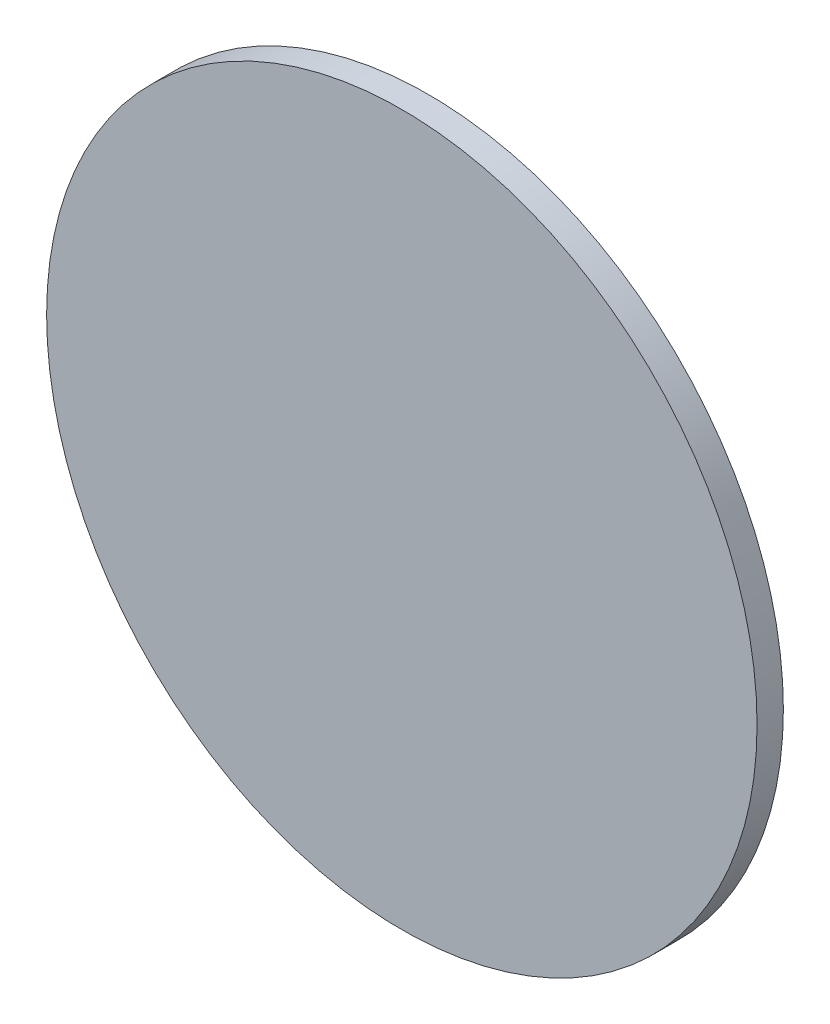
ISO-10303-21;
HEADER;
FILE_DESCRIPTION(('STEP AP214'),'2;1');
FILE_NAME('part.step','',(''),(''),'','','');
FILE_SCHEMA(('AUTOMOTIVE_DESIGN { 1 0 10303 214 1 1 1 1 }'));
ENDSEC;
DATA;
#1=APPLICATION_CONTEXT('core data for automotive mechanical design processes');
#2=APPLICATION_PROTOCOL_DEFINITION('international standard','automotive_design',2000,#1);
#3=PRODUCT_CONTEXT('',#1,'mechanical');
#4=PRODUCT('Part','Part','',(#3));
#5=PRODUCT_RELATED_PRODUCT_CATEGORY('part','',(#4));
#6=PRODUCT_DEFINITION_FORMATION('','',#4);
#7=PRODUCT_DEFINITION_CONTEXT('part definition',#1,'design');
#8=PRODUCT_DEFINITION('design','',#6,#7);
#9=PRODUCT_DEFINITION_SHAPE('','',#8);
#10=(LENGTH_UNIT() NAMED_UNIT(*) SI_UNIT(.MILLI.,.METRE.));
#11=(NAMED_UNIT(*) PLANE_ANGLE_UNIT() SI_UNIT($,.RADIAN.));
#12=(NAMED_UNIT(*) SI_UNIT($,.STERADIAN.) SOLID_ANGLE_UNIT());
#13=UNCERTAINTY_MEASURE_WITH_UNIT(LENGTH_MEASURE(1.E-05),#10,'distance_accuracy_value','');
#14=(GEOMETRIC_REPRESENTATION_CONTEXT(3) GLOBAL_UNCERTAINTY_ASSIGNED_CONTEXT((#13)) GLOBAL_UNIT_ASSIGNED_CONTEXT((#10,
#11,#12)) REPRESENTATION_CONTEXT('',''));
#15=CARTESIAN_POINT('',(0.,0.,0.));
#16=DIRECTION('',(0.,0.,1.));
#17=DIRECTION('',(1.,0.,0.));
#18=AXIS2_PLACEMENT_3D('',#15,#16,#17);
#19=CARTESIAN_POINT('',(0.,0.,2.));
#20=DIRECTION('',(0.,0.,-1.));
#21=DIRECTION('',(-1.,0.,0.));
#22=AXIS2_PLACEMENT_3D('',#19,#20,#21);
#23=CYLINDRICAL_SURFACE('',#22,27.);
#24=CARTESIAN_POINT('',(0.,0.,2.));
#25=DIRECTION('',(0.,0.,1.));
#26=DIRECTION('',(1.,0.,0.));
#27=AXIS2_PLACEMENT_3D('',#24,#25,#26);
#28=CIRCLE('',#27,27.);
#29=CARTESIAN_POINT('',(27.,0.,2.));
#30=VERTEX_POINT('',#29);
#31=EDGE_CURVE('E10',#30,#30,#28,.T.);
#32=ORIENTED_EDGE('',*,*,#31,.F.);
#33=EDGE_LOOP('',(#32));
#34=FACE_BOUND('',#33,.T.);
#35=CARTESIAN_POINT('',(0.,0.,0.));
#36=DIRECTION('',(0.,0.,1.));
#37=DIRECTION('',(1.,0.,0.));
#38=AXIS2_PLACEMENT_3D('',#35,#36,#37);
#39=CIRCLE('',#38,27.);
#40=CARTESIAN_POINT('',(27.,0.,0.));
#41=VERTEX_POINT('',#40);
#42=EDGE_CURVE('E44',#41,#41,#39,.T.);
#43=ORIENTED_EDGE('',*,*,#42,.T.);
#44=EDGE_LOOP('',(#43));
#45=FACE_BOUND('',#44,.T.);
#46=ADVANCED_FACE('F41',(#34,#45),#23,.T.);
#47=CARTESIAN_POINT('',(0.,0.,2.));
#48=DIRECTION('',(0.,0.,1.));
#49=DIRECTION('',(1.,0.,0.));
#50=AXIS2_PLACEMENT_3D('',#47,#48,#49);
#51=PLANE('',#50);
#52=ORIENTED_EDGE('',*,*,#31,.T.);
#53=EDGE_LOOP('',(#52));
#54=FACE_BOUND('',#53,.T.);
#55=ADVANCED_FACE('F58',(#54),#51,.T.);
#56=CARTESIAN_POINT('',(0.,0.,0.));
#57=DIRECTION('',(0.,0.,1.));
#58=DIRECTION('',(1.,0.,0.));
#59=AXIS2_PLACEMENT_3D('',#56,#57,#58);
#60=PLANE('',#59);
#61=ORIENTED_EDGE('',*,*,#42,.F.);
#62=EDGE_LOOP('',(#61));
#63=FACE_BOUND('',#62,.T.);
#64=ADVANCED_FACE('F56',(#63),#60,.F.);
#65=CLOSED_SHELL('',(#46,#55,#64));
#66=MANIFOLD_SOLID_BREP('B2',#65);
#67=ADVANCED_BREP_SHAPE_REPRESENTATION('',(#18,#66),#14);
#68=SHAPE_DEFINITION_REPRESENTATION(#9,#67);
ENDSEC;
END-ISO-10303-21;
